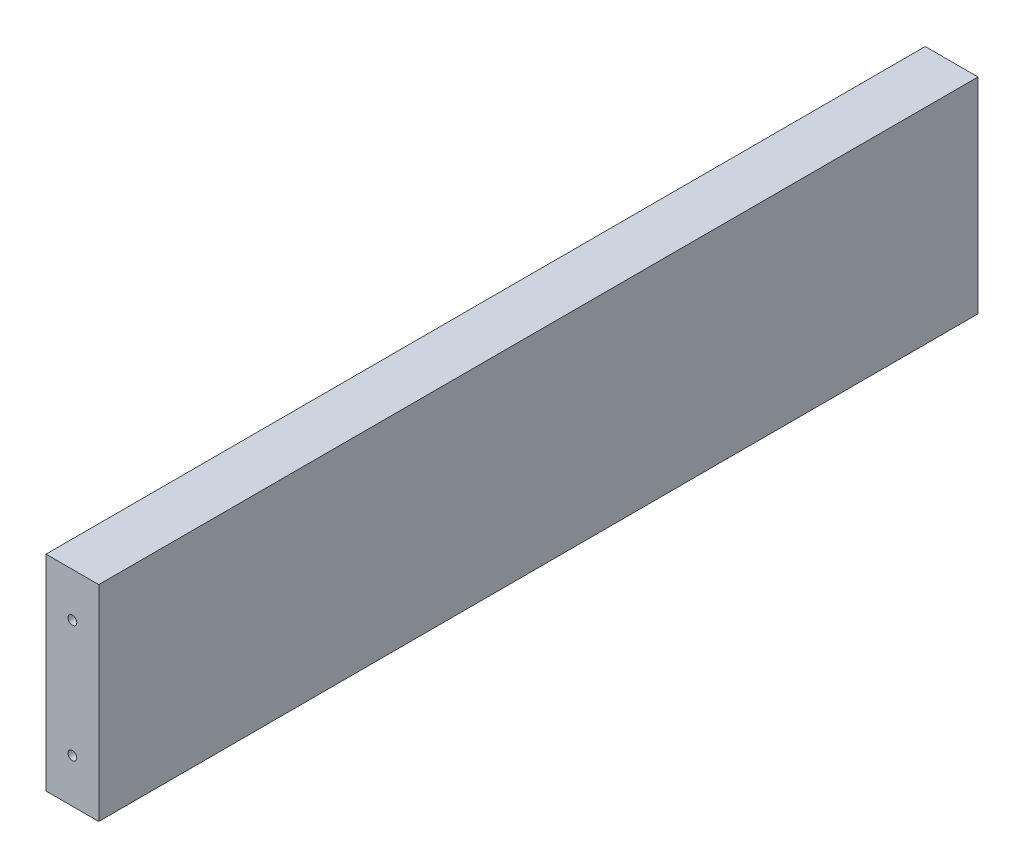
ISO-10303-21;
HEADER;
FILE_DESCRIPTION(('STEP AP214'),'2;1');
FILE_NAME('part.step','',(''),(''),'','','');
FILE_SCHEMA(('AUTOMOTIVE_DESIGN { 1 0 10303 214 1 1 1 1 }'));
ENDSEC;
DATA;
#1=APPLICATION_CONTEXT('core data for automotive mechanical design processes');
#2=APPLICATION_PROTOCOL_DEFINITION('international standard','automotive_design',2000,#1);
#3=PRODUCT_CONTEXT('',#1,'mechanical');
#4=PRODUCT('Part','Part','',(#3));
#5=PRODUCT_RELATED_PRODUCT_CATEGORY('part','',(#4));
#6=PRODUCT_DEFINITION_FORMATION('','',#4);
#7=PRODUCT_DEFINITION_CONTEXT('part definition',#1,'design');
#8=PRODUCT_DEFINITION('design','',#6,#7);
#9=PRODUCT_DEFINITION_SHAPE('','',#8);
#10=(LENGTH_UNIT() NAMED_UNIT(*) SI_UNIT(.MILLI.,.METRE.));
#11=(NAMED_UNIT(*) PLANE_ANGLE_UNIT() SI_UNIT($,.RADIAN.));
#12=(NAMED_UNIT(*) SI_UNIT($,.STERADIAN.) SOLID_ANGLE_UNIT());
#13=UNCERTAINTY_MEASURE_WITH_UNIT(LENGTH_MEASURE(1.E-05),#10,'distance_accuracy_value','');
#14=(GEOMETRIC_REPRESENTATION_CONTEXT(3) GLOBAL_UNCERTAINTY_ASSIGNED_CONTEXT((#13)) GLOBAL_UNIT_ASSIGNED_CONTEXT((#10,
#11,#12)) REPRESENTATION_CONTEXT('',''));
#15=CARTESIAN_POINT('',(0.,0.,0.));
#16=DIRECTION('',(0.,0.,1.));
#17=DIRECTION('',(1.,0.,0.));
#18=AXIS2_PLACEMENT_3D('',#15,#16,#17);
#19=CARTESIAN_POINT('',(-132.,7.5,-90.));
#20=DIRECTION('',(-1.,0.,0.));
#21=DIRECTION('',(0.,0.,1.));
#22=AXIS2_PLACEMENT_3D('',#19,#20,#21);
#23=CYLINDRICAL_SURFACE('',#22,1.5);
#24=CARTESIAN_POINT('',(-150.,7.5,-90.));
#25=DIRECTION('',(1.,0.,0.));
#26=DIRECTION('',(0.,0.,-1.));
#27=AXIS2_PLACEMENT_3D('',#24,#25,#26);
#28=CIRCLE('',#27,1.5);
#29=CARTESIAN_POINT('',(-150.,7.5,-91.5));
#30=VERTEX_POINT('',#29);
#31=EDGE_CURVE('E99',#30,#30,#28,.T.);
#32=ORIENTED_EDGE('',*,*,#31,.F.);
#33=EDGE_LOOP('',(#32));
#34=FACE_BOUND('',#33,.T.);
#35=CARTESIAN_POINT('',(-144.,7.5,-90.));
#36=DIRECTION('',(1.,0.,0.));
#37=DIRECTION('',(0.,0.,-1.));
#38=AXIS2_PLACEMENT_3D('',#35,#36,#37);
#39=CIRCLE('',#38,1.5);
#40=CARTESIAN_POINT('',(-144.,7.5,-91.5));
#41=VERTEX_POINT('',#40);
#42=EDGE_CURVE('E155',#41,#41,#39,.T.);
#43=ORIENTED_EDGE('',*,*,#42,.T.);
#44=EDGE_LOOP('',(#43));
#45=FACE_BOUND('',#44,.T.);
#46=ADVANCED_FACE('F32',(#34,#45),#23,.F.);
#47=CARTESIAN_POINT('',(-132.,-7.5,-90.));
#48=DIRECTION('',(-1.,0.,0.));
#49=DIRECTION('',(0.,0.,1.));
#50=AXIS2_PLACEMENT_3D('',#47,#48,#49);
#51=CYLINDRICAL_SURFACE('',#50,1.5);
#52=CARTESIAN_POINT('',(-150.,-7.5,-90.));
#53=DIRECTION('',(1.,0.,0.));
#54=DIRECTION('',(0.,0.,-1.));
#55=AXIS2_PLACEMENT_3D('',#52,#53,#54);
#56=CIRCLE('',#55,1.5);
#57=CARTESIAN_POINT('',(-150.,-7.5,-91.5));
#58=VERTEX_POINT('',#57);
#59=EDGE_CURVE('E116',#58,#58,#56,.T.);
#60=ORIENTED_EDGE('',*,*,#59,.F.);
#61=EDGE_LOOP('',(#60));
#62=FACE_BOUND('',#61,.T.);
#63=CARTESIAN_POINT('',(-144.,-7.5,-90.));
#64=DIRECTION('',(1.,0.,0.));
#65=DIRECTION('',(0.,0.,-1.));
#66=AXIS2_PLACEMENT_3D('',#63,#64,#65);
#67=CIRCLE('',#66,1.5);
#68=CARTESIAN_POINT('',(-144.,-7.5,-91.5));
#69=VERTEX_POINT('',#68);
#70=EDGE_CURVE('E152',#69,#69,#67,.T.);
#71=ORIENTED_EDGE('',*,*,#70,.T.);
#72=EDGE_LOOP('',(#71));
#73=FACE_BOUND('',#72,.T.);
#74=ADVANCED_FACE('F171',(#62,#73),#51,.F.);
#75=CARTESIAN_POINT('',(-132.,7.5,-140.));
#76=DIRECTION('',(-1.,0.,0.));
#77=DIRECTION('',(0.,0.,1.));
#78=AXIS2_PLACEMENT_3D('',#75,#76,#77);
#79=CYLINDRICAL_SURFACE('',#78,1.5);
#80=CARTESIAN_POINT('',(-150.,7.5,-140.));
#81=DIRECTION('',(1.,0.,0.));
#82=DIRECTION('',(0.,0.,-1.));
#83=AXIS2_PLACEMENT_3D('',#80,#81,#82);
#84=CIRCLE('',#83,1.5);
#85=CARTESIAN_POINT('',(-150.,7.5,-141.5));
#86=VERTEX_POINT('',#85);
#87=EDGE_CURVE('E113',#86,#86,#84,.T.);
#88=ORIENTED_EDGE('',*,*,#87,.F.);
#89=EDGE_LOOP('',(#88));
#90=FACE_BOUND('',#89,.T.);
#91=CARTESIAN_POINT('',(-144.,7.5,-140.));
#92=DIRECTION('',(1.,0.,0.));
#93=DIRECTION('',(0.,0.,-1.));
#94=AXIS2_PLACEMENT_3D('',#91,#92,#93);
#95=CIRCLE('',#94,1.5);
#96=CARTESIAN_POINT('',(-144.,7.5,-141.5));
#97=VERTEX_POINT('',#96);
#98=EDGE_CURVE('E149',#97,#97,#95,.T.);
#99=ORIENTED_EDGE('',*,*,#98,.T.);
#100=EDGE_LOOP('',(#99));
#101=FACE_BOUND('',#100,.T.);
#102=ADVANCED_FACE('F177',(#90,#101),#79,.F.);
#103=CARTESIAN_POINT('',(-132.,-7.5,-140.));
#104=DIRECTION('',(-1.,0.,0.));
#105=DIRECTION('',(0.,0.,1.));
#106=AXIS2_PLACEMENT_3D('',#103,#104,#105);
#107=CYLINDRICAL_SURFACE('',#106,1.5);
#108=CARTESIAN_POINT('',(-150.,-7.5,-140.));
#109=DIRECTION('',(1.,0.,0.));
#110=DIRECTION('',(0.,0.,-1.));
#111=AXIS2_PLACEMENT_3D('',#108,#109,#110);
#112=CIRCLE('',#111,1.5);
#113=CARTESIAN_POINT('',(-150.,-7.5,-141.5));
#114=VERTEX_POINT('',#113);
#115=EDGE_CURVE('E119',#114,#114,#112,.T.);
#116=ORIENTED_EDGE('',*,*,#115,.F.);
#117=EDGE_LOOP('',(#116));
#118=FACE_BOUND('',#117,.T.);
#119=CARTESIAN_POINT('',(-144.,-7.5,-140.));
#120=DIRECTION('',(1.,0.,0.));
#121=DIRECTION('',(0.,0.,-1.));
#122=AXIS2_PLACEMENT_3D('',#119,#120,#121);
#123=CIRCLE('',#122,1.5);
#124=CARTESIAN_POINT('',(-144.,-7.5,-141.5));
#125=VERTEX_POINT('',#124);
#126=EDGE_CURVE('E139',#125,#125,#123,.T.);
#127=ORIENTED_EDGE('',*,*,#126,.T.);
#128=EDGE_LOOP('',(#127));
#129=FACE_BOUND('',#128,.T.);
#130=ADVANCED_FACE('F185',(#118,#129),#107,.F.);
#131=CARTESIAN_POINT('',(-132.,0.,0.));
#132=DIRECTION('',(-1.,0.,0.));
#133=DIRECTION('',(0.,0.,1.));
#134=AXIS2_PLACEMENT_3D('',#131,#132,#133);
#135=PLANE('',#134);
#136=DIRECTION('',(0.,1.,0.));
#137=VECTOR('',#136,1.);
#138=CARTESIAN_POINT('',(-132.,-35.,-150.));
#139=LINE('',#138,#137);
#140=CARTESIAN_POINT('',(-132.,-35.,-150.));
#141=VERTEX_POINT('',#140);
#142=CARTESIAN_POINT('',(-132.,35.,-150.));
#143=VERTEX_POINT('',#142);
#144=EDGE_CURVE('E84',#141,#143,#139,.T.);
#145=ORIENTED_EDGE('',*,*,#144,.T.);
#146=DIRECTION('',(0.,0.,1.));
#147=VECTOR('',#146,1.);
#148=CARTESIAN_POINT('',(-132.,35.,150.));
#149=LINE('',#148,#147);
#150=CARTESIAN_POINT('',(-132.,35.,150.));
#151=VERTEX_POINT('',#150);
#152=EDGE_CURVE('E79',#143,#151,#149,.T.);
#153=ORIENTED_EDGE('',*,*,#152,.T.);
#154=DIRECTION('',(0.,-1.,0.));
#155=VECTOR('',#154,1.);
#156=CARTESIAN_POINT('',(-132.,-35.,150.));
#157=LINE('',#156,#155);
#158=CARTESIAN_POINT('',(-132.,-35.,150.));
#159=VERTEX_POINT('',#158);
#160=EDGE_CURVE('E82',#151,#159,#157,.T.);
#161=ORIENTED_EDGE('',*,*,#160,.T.);
#162=DIRECTION('',(0.,0.,-1.));
#163=VECTOR('',#162,1.);
#164=CARTESIAN_POINT('',(-132.,-35.,150.));
#165=LINE('',#164,#163);
#166=EDGE_CURVE('E49',#159,#141,#165,.T.);
#167=ORIENTED_EDGE('',*,*,#166,.T.);
#168=EDGE_LOOP('',(#145,#153,#161,#167));
#169=FACE_BOUND('',#168,.T.);
#170=ADVANCED_FACE('F80',(#169),#135,.F.);
#171=CARTESIAN_POINT('',(-150.,0.,0.));
#172=DIRECTION('',(-1.,0.,0.));
#173=DIRECTION('',(0.,0.,1.));
#174=AXIS2_PLACEMENT_3D('',#171,#172,#173);
#175=PLANE('',#174);
#176=ORIENTED_EDGE('',*,*,#59,.T.);
#177=EDGE_LOOP('',(#176));
#178=FACE_BOUND('',#177,.T.);
#179=ORIENTED_EDGE('',*,*,#31,.T.);
#180=EDGE_LOOP('',(#179));
#181=FACE_BOUND('',#180,.T.);
#182=DIRECTION('',(0.,1.,0.));
#183=VECTOR('',#182,1.);
#184=CARTESIAN_POINT('',(-150.,-35.,-150.));
#185=LINE('',#184,#183);
#186=CARTESIAN_POINT('',(-150.,-35.,-150.));
#187=VERTEX_POINT('',#186);
#188=CARTESIAN_POINT('',(-150.,35.,-150.));
#189=VERTEX_POINT('',#188);
#190=EDGE_CURVE('E96',#187,#189,#185,.T.);
#191=ORIENTED_EDGE('',*,*,#190,.F.);
#192=DIRECTION('',(0.,0.,-1.));
#193=VECTOR('',#192,1.);
#194=CARTESIAN_POINT('',(-150.,-35.,150.));
#195=LINE('',#194,#193);
#196=CARTESIAN_POINT('',(-150.,-35.,150.));
#197=VERTEX_POINT('',#196);
#198=EDGE_CURVE('E72',#197,#187,#195,.T.);
#199=ORIENTED_EDGE('',*,*,#198,.F.);
#200=DIRECTION('',(0.,-1.,0.));
#201=VECTOR('',#200,1.);
#202=CARTESIAN_POINT('',(-150.,-35.,150.));
#203=LINE('',#202,#201);
#204=CARTESIAN_POINT('',(-150.,35.,150.));
#205=VERTEX_POINT('',#204);
#206=EDGE_CURVE('E66',#205,#197,#203,.T.);
#207=ORIENTED_EDGE('',*,*,#206,.F.);
#208=DIRECTION('',(0.,0.,1.));
#209=VECTOR('',#208,1.);
#210=CARTESIAN_POINT('',(-150.,35.,150.));
#211=LINE('',#210,#209);
#212=EDGE_CURVE('E88',#189,#205,#211,.T.);
#213=ORIENTED_EDGE('',*,*,#212,.F.);
#214=EDGE_LOOP('',(#191,#199,#207,#213));
#215=FACE_BOUND('',#214,.T.);
#216=ORIENTED_EDGE('',*,*,#87,.T.);
#217=EDGE_LOOP('',(#216));
#218=FACE_BOUND('',#217,.T.);
#219=ORIENTED_EDGE('',*,*,#115,.T.);
#220=EDGE_LOOP('',(#219));
#221=FACE_BOUND('',#220,.T.);
#222=ADVANCED_FACE('F107',(#178,#181,#215,#218,#221),#175,.T.);
#223=CARTESIAN_POINT('',(-132.,-35.,-150.));
#224=DIRECTION('',(0.,0.,1.));
#225=DIRECTION('',(1.,0.,0.));
#226=AXIS2_PLACEMENT_3D('',#223,#224,#225);
#227=PLANE('',#226);
#228=CARTESIAN_POINT('',(-141.,-20.,-150.));
#229=DIRECTION('',(0.,0.,-1.));
#230=DIRECTION('',(-1.,0.,0.));
#231=AXIS2_PLACEMENT_3D('',#228,#229,#230);
#232=CIRCLE('',#231,1.5);
#233=CARTESIAN_POINT('',(-142.5,-20.,-150.));
#234=VERTEX_POINT('',#233);
#235=EDGE_CURVE('E142',#234,#234,#232,.T.);
#236=ORIENTED_EDGE('',*,*,#235,.F.);
#237=EDGE_LOOP('',(#236));
#238=FACE_BOUND('',#237,.T.);
#239=CARTESIAN_POINT('',(-141.,20.,-150.));
#240=DIRECTION('',(0.,0.,-1.));
#241=DIRECTION('',(-1.,0.,0.));
#242=AXIS2_PLACEMENT_3D('',#239,#240,#241);
#243=CIRCLE('',#242,1.5);
#244=CARTESIAN_POINT('',(-142.5,20.,-150.));
#245=VERTEX_POINT('',#244);
#246=EDGE_CURVE('E135',#245,#245,#243,.T.);
#247=ORIENTED_EDGE('',*,*,#246,.F.);
#248=EDGE_LOOP('',(#247));
#249=FACE_BOUND('',#248,.T.);
#250=ORIENTED_EDGE('',*,*,#190,.T.);
#251=DIRECTION('',(-1.,0.,0.));
#252=VECTOR('',#251,1.);
#253=CARTESIAN_POINT('',(-132.,35.,-150.));
#254=LINE('',#253,#252);
#255=EDGE_CURVE('E11',#143,#189,#254,.T.);
#256=ORIENTED_EDGE('',*,*,#255,.F.);
#257=ORIENTED_EDGE('',*,*,#144,.F.);
#258=DIRECTION('',(-1.,0.,0.));
#259=VECTOR('',#258,1.);
#260=CARTESIAN_POINT('',(-132.,-35.,-150.));
#261=LINE('',#260,#259);
#262=EDGE_CURVE('E92',#141,#187,#261,.T.);
#263=ORIENTED_EDGE('',*,*,#262,.T.);
#264=EDGE_LOOP('',(#250,#256,#257,#263));
#265=FACE_BOUND('',#264,.T.);
#266=ADVANCED_FACE('F34',(#238,#249,#265),#227,.F.);
#267=CARTESIAN_POINT('',(-132.,35.,150.));
#268=DIRECTION('',(0.,-1.,0.));
#269=DIRECTION('',(0.,0.,-1.));
#270=AXIS2_PLACEMENT_3D('',#267,#268,#269);
#271=PLANE('',#270);
#272=ORIENTED_EDGE('',*,*,#212,.T.);
#273=DIRECTION('',(-1.,0.,0.));
#274=VECTOR('',#273,1.);
#275=CARTESIAN_POINT('',(-132.,35.,150.));
#276=LINE('',#275,#274);
#277=EDGE_CURVE('E41',#151,#205,#276,.T.);
#278=ORIENTED_EDGE('',*,*,#277,.F.);
#279=ORIENTED_EDGE('',*,*,#152,.F.);
#280=ORIENTED_EDGE('',*,*,#255,.T.);
#281=EDGE_LOOP('',(#272,#278,#279,#280));
#282=FACE_BOUND('',#281,.T.);
#283=ADVANCED_FACE('F87',(#282),#271,.F.);
#284=CARTESIAN_POINT('',(-132.,-35.,150.));
#285=DIRECTION('',(0.,0.,-1.));
#286=DIRECTION('',(-1.,0.,0.));
#287=AXIS2_PLACEMENT_3D('',#284,#285,#286);
#288=PLANE('',#287);
#289=CARTESIAN_POINT('',(-141.,-20.,150.));
#290=DIRECTION('',(0.,0.,1.));
#291=DIRECTION('',(1.,0.,0.));
#292=AXIS2_PLACEMENT_3D('',#289,#290,#291);
#293=CIRCLE('',#292,1.5);
#294=CARTESIAN_POINT('',(-139.5,-20.,150.));
#295=VERTEX_POINT('',#294);
#296=EDGE_CURVE('E130',#295,#295,#293,.T.);
#297=ORIENTED_EDGE('',*,*,#296,.F.);
#298=EDGE_LOOP('',(#297));
#299=FACE_BOUND('',#298,.T.);
#300=CARTESIAN_POINT('',(-141.,20.,150.));
#301=DIRECTION('',(0.,0.,1.));
#302=DIRECTION('',(1.,0.,0.));
#303=AXIS2_PLACEMENT_3D('',#300,#301,#302);
#304=CIRCLE('',#303,1.5);
#305=CARTESIAN_POINT('',(-139.5,20.,150.));
#306=VERTEX_POINT('',#305);
#307=EDGE_CURVE('E123',#306,#306,#304,.T.);
#308=ORIENTED_EDGE('',*,*,#307,.F.);
#309=EDGE_LOOP('',(#308));
#310=FACE_BOUND('',#309,.T.);
#311=ORIENTED_EDGE('',*,*,#206,.T.);
#312=DIRECTION('',(-1.,0.,0.));
#313=VECTOR('',#312,1.);
#314=CARTESIAN_POINT('',(-132.,-35.,150.));
#315=LINE('',#314,#313);
#316=EDGE_CURVE('E89',#159,#197,#315,.T.);
#317=ORIENTED_EDGE('',*,*,#316,.F.);
#318=ORIENTED_EDGE('',*,*,#160,.F.);
#319=ORIENTED_EDGE('',*,*,#277,.T.);
#320=EDGE_LOOP('',(#311,#317,#318,#319));
#321=FACE_BOUND('',#320,.T.);
#322=ADVANCED_FACE('F90',(#299,#310,#321),#288,.F.);
#323=CARTESIAN_POINT('',(-132.,-35.,150.));
#324=DIRECTION('',(0.,1.,0.));
#325=DIRECTION('',(0.,0.,1.));
#326=AXIS2_PLACEMENT_3D('',#323,#324,#325);
#327=PLANE('',#326);
#328=ORIENTED_EDGE('',*,*,#198,.T.);
#329=ORIENTED_EDGE('',*,*,#262,.F.);
#330=ORIENTED_EDGE('',*,*,#166,.F.);
#331=ORIENTED_EDGE('',*,*,#316,.T.);
#332=EDGE_LOOP('',(#328,#329,#330,#331));
#333=FACE_BOUND('',#332,.T.);
#334=ADVANCED_FACE('F104',(#333),#327,.F.);
#335=CARTESIAN_POINT('',(-141.,20.,138.));
#336=DIRECTION('',(0.,0.,1.));
#337=DIRECTION('',(1.,0.,0.));
#338=AXIS2_PLACEMENT_3D('',#335,#336,#337);
#339=CYLINDRICAL_SURFACE('',#338,1.5);
#340=CARTESIAN_POINT('',(-141.,20.,138.));
#341=DIRECTION('',(0.,0.,1.));
#342=DIRECTION('',(1.,0.,0.));
#343=AXIS2_PLACEMENT_3D('',#340,#341,#342);
#344=CIRCLE('',#343,1.5);
#345=CARTESIAN_POINT('',(-139.5,20.,138.));
#346=VERTEX_POINT('',#345);
#347=EDGE_CURVE('E126',#346,#346,#344,.T.);
#348=ORIENTED_EDGE('',*,*,#347,.F.);
#349=EDGE_LOOP('',(#348));
#350=FACE_BOUND('',#349,.T.);
#351=ORIENTED_EDGE('',*,*,#307,.T.);
#352=EDGE_LOOP('',(#351));
#353=FACE_BOUND('',#352,.T.);
#354=ADVANCED_FACE('F191',(#350,#353),#339,.F.);
#355=CARTESIAN_POINT('',(-141.,20.,138.));
#356=DIRECTION('',(0.,0.,1.));
#357=DIRECTION('',(1.,0.,0.));
#358=AXIS2_PLACEMENT_3D('',#355,#356,#357);
#359=PLANE('',#358);
#360=ORIENTED_EDGE('',*,*,#347,.T.);
#361=EDGE_LOOP('',(#360));
#362=FACE_BOUND('',#361,.T.);
#363=ADVANCED_FACE('F226',(#362),#359,.T.);
#364=CARTESIAN_POINT('',(-141.,-20.,138.));
#365=DIRECTION('',(0.,0.,1.));
#366=DIRECTION('',(1.,0.,0.));
#367=AXIS2_PLACEMENT_3D('',#364,#365,#366);
#368=CYLINDRICAL_SURFACE('',#367,1.5);
#369=CARTESIAN_POINT('',(-141.,-20.,138.));
#370=DIRECTION('',(0.,0.,1.));
#371=DIRECTION('',(1.,0.,0.));
#372=AXIS2_PLACEMENT_3D('',#369,#370,#371);
#373=CIRCLE('',#372,1.5);
#374=CARTESIAN_POINT('',(-139.5,-20.,138.));
#375=VERTEX_POINT('',#374);
#376=EDGE_CURVE('E122',#375,#375,#373,.T.);
#377=ORIENTED_EDGE('',*,*,#376,.F.);
#378=EDGE_LOOP('',(#377));
#379=FACE_BOUND('',#378,.T.);
#380=ORIENTED_EDGE('',*,*,#296,.T.);
#381=EDGE_LOOP('',(#380));
#382=FACE_BOUND('',#381,.T.);
#383=ADVANCED_FACE('F218',(#379,#382),#368,.F.);
#384=CARTESIAN_POINT('',(-141.,-20.,138.));
#385=DIRECTION('',(0.,0.,1.));
#386=DIRECTION('',(1.,0.,0.));
#387=AXIS2_PLACEMENT_3D('',#384,#385,#386);
#388=PLANE('',#387);
#389=ORIENTED_EDGE('',*,*,#376,.T.);
#390=EDGE_LOOP('',(#389));
#391=FACE_BOUND('',#390,.T.);
#392=ADVANCED_FACE('F208',(#391),#388,.T.);
#393=CARTESIAN_POINT('',(-141.,20.,-138.));
#394=DIRECTION('',(0.,0.,-1.));
#395=DIRECTION('',(-1.,0.,0.));
#396=AXIS2_PLACEMENT_3D('',#393,#394,#395);
#397=CYLINDRICAL_SURFACE('',#396,1.5);
#398=CARTESIAN_POINT('',(-141.,20.,-138.));
#399=DIRECTION('',(0.,0.,-1.));
#400=DIRECTION('',(-1.,0.,0.));
#401=AXIS2_PLACEMENT_3D('',#398,#399,#400);
#402=CIRCLE('',#401,1.5);
#403=CARTESIAN_POINT('',(-142.5,20.,-138.));
#404=VERTEX_POINT('',#403);
#405=EDGE_CURVE('E138',#404,#404,#402,.T.);
#406=ORIENTED_EDGE('',*,*,#405,.F.);
#407=EDGE_LOOP('',(#406));
#408=FACE_BOUND('',#407,.T.);
#409=ORIENTED_EDGE('',*,*,#246,.T.);
#410=EDGE_LOOP('',(#409));
#411=FACE_BOUND('',#410,.T.);
#412=ADVANCED_FACE('F205',(#408,#411),#397,.F.);
#413=CARTESIAN_POINT('',(-141.,20.,-138.));
#414=DIRECTION('',(0.,0.,-1.));
#415=DIRECTION('',(-1.,0.,0.));
#416=AXIS2_PLACEMENT_3D('',#413,#414,#415);
#417=PLANE('',#416);
#418=ORIENTED_EDGE('',*,*,#405,.T.);
#419=EDGE_LOOP('',(#418));
#420=FACE_BOUND('',#419,.T.);
#421=ADVANCED_FACE('F207',(#420),#417,.T.);
#422=CARTESIAN_POINT('',(-141.,-20.,-138.));
#423=DIRECTION('',(0.,0.,-1.));
#424=DIRECTION('',(-1.,0.,0.));
#425=AXIS2_PLACEMENT_3D('',#422,#423,#424);
#426=CYLINDRICAL_SURFACE('',#425,1.5);
#427=CARTESIAN_POINT('',(-141.,-20.,-138.));
#428=DIRECTION('',(0.,0.,-1.));
#429=DIRECTION('',(-1.,0.,0.));
#430=AXIS2_PLACEMENT_3D('',#427,#428,#429);
#431=CIRCLE('',#430,1.5);
#432=CARTESIAN_POINT('',(-142.5,-20.,-138.));
#433=VERTEX_POINT('',#432);
#434=EDGE_CURVE('E127',#433,#433,#431,.T.);
#435=ORIENTED_EDGE('',*,*,#434,.F.);
#436=EDGE_LOOP('',(#435));
#437=FACE_BOUND('',#436,.T.);
#438=ORIENTED_EDGE('',*,*,#235,.T.);
#439=EDGE_LOOP('',(#438));
#440=FACE_BOUND('',#439,.T.);
#441=ADVANCED_FACE('F215',(#437,#440),#426,.F.);
#442=CARTESIAN_POINT('',(-141.,-20.,-138.));
#443=DIRECTION('',(0.,0.,-1.));
#444=DIRECTION('',(-1.,0.,0.));
#445=AXIS2_PLACEMENT_3D('',#442,#443,#444);
#446=PLANE('',#445);
#447=ORIENTED_EDGE('',*,*,#434,.T.);
#448=EDGE_LOOP('',(#447));
#449=FACE_BOUND('',#448,.T.);
#450=ADVANCED_FACE('F246',(#449),#446,.T.);
#451=CARTESIAN_POINT('',(-144.,-7.5,-140.));
#452=DIRECTION('',(1.,0.,0.));
#453=DIRECTION('',(0.,0.,-1.));
#454=AXIS2_PLACEMENT_3D('',#451,#452,#453);
#455=PLANE('',#454);
#456=ORIENTED_EDGE('',*,*,#126,.F.);
#457=EDGE_LOOP('',(#456));
#458=FACE_BOUND('',#457,.T.);
#459=ADVANCED_FACE('F244',(#458),#455,.F.);
#460=CARTESIAN_POINT('',(-144.,7.5,-140.));
#461=DIRECTION('',(1.,0.,0.));
#462=DIRECTION('',(0.,0.,-1.));
#463=AXIS2_PLACEMENT_3D('',#460,#461,#462);
#464=PLANE('',#463);
#465=ORIENTED_EDGE('',*,*,#98,.F.);
#466=EDGE_LOOP('',(#465));
#467=FACE_BOUND('',#466,.T.);
#468=ADVANCED_FACE('F167',(#467),#464,.F.);
#469=CARTESIAN_POINT('',(-144.,-7.5,-90.));
#470=DIRECTION('',(1.,0.,0.));
#471=DIRECTION('',(0.,0.,-1.));
#472=AXIS2_PLACEMENT_3D('',#469,#470,#471);
#473=PLANE('',#472);
#474=ORIENTED_EDGE('',*,*,#70,.F.);
#475=EDGE_LOOP('',(#474));
#476=FACE_BOUND('',#475,.T.);
#477=ADVANCED_FACE('F162',(#476),#473,.F.);
#478=CARTESIAN_POINT('',(-144.,7.5,-90.));
#479=DIRECTION('',(1.,0.,0.));
#480=DIRECTION('',(0.,0.,-1.));
#481=AXIS2_PLACEMENT_3D('',#478,#479,#480);
#482=PLANE('',#481);
#483=ORIENTED_EDGE('',*,*,#42,.F.);
#484=EDGE_LOOP('',(#483));
#485=FACE_BOUND('',#484,.T.);
#486=ADVANCED_FACE('F160',(#485),#482,.F.);
#487=CLOSED_SHELL('',(#46,#74,#102,#130,#170,#222,#266,#283,#322,#334,#354,#363,#383,#392,#412,
#421,#441,#450,#459,#468,#477,#486));
#488=MANIFOLD_SOLID_BREP('B2',#487);
#489=ADVANCED_BREP_SHAPE_REPRESENTATION('',(#18,#488),#14);
#490=SHAPE_DEFINITION_REPRESENTATION(#9,#489);
ENDSEC;
END-ISO-10303-21;
